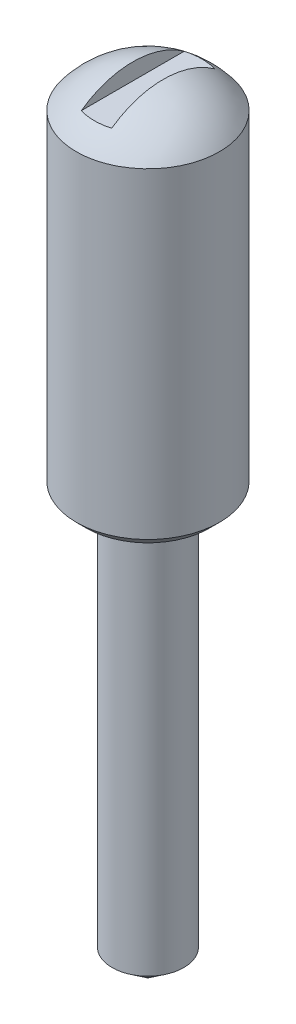
ISO-10303-21;
HEADER;
FILE_DESCRIPTION(('STEP AP214'),'2;1');
FILE_NAME('part.step','',(''),(''),'','','');
FILE_SCHEMA(('AUTOMOTIVE_DESIGN { 1 0 10303 214 1 1 1 1 }'));
ENDSEC;
DATA;
#1=APPLICATION_CONTEXT('core data for automotive mechanical design processes');
#2=APPLICATION_PROTOCOL_DEFINITION('international standard','automotive_design',2000,#1);
#3=PRODUCT_CONTEXT('',#1,'mechanical');
#4=PRODUCT('Part','Part','',(#3));
#5=PRODUCT_RELATED_PRODUCT_CATEGORY('part','',(#4));
#6=PRODUCT_DEFINITION_FORMATION('','',#4);
#7=PRODUCT_DEFINITION_CONTEXT('part definition',#1,'design');
#8=PRODUCT_DEFINITION('design','',#6,#7);
#9=PRODUCT_DEFINITION_SHAPE('','',#8);
#10=(LENGTH_UNIT() NAMED_UNIT(*) SI_UNIT(.MILLI.,.METRE.));
#11=(NAMED_UNIT(*) PLANE_ANGLE_UNIT() SI_UNIT($,.RADIAN.));
#12=(NAMED_UNIT(*) SI_UNIT($,.STERADIAN.) SOLID_ANGLE_UNIT());
#13=UNCERTAINTY_MEASURE_WITH_UNIT(LENGTH_MEASURE(1.E-05),#10,'distance_accuracy_value','');
#14=(GEOMETRIC_REPRESENTATION_CONTEXT(3) GLOBAL_UNCERTAINTY_ASSIGNED_CONTEXT((#13)) GLOBAL_UNIT_ASSIGNED_CONTEXT((#10,
#11,#12)) REPRESENTATION_CONTEXT('',''));
#15=CARTESIAN_POINT('',(0.,0.,0.));
#16=DIRECTION('',(0.,0.,1.));
#17=DIRECTION('',(1.,0.,0.));
#18=AXIS2_PLACEMENT_3D('',#15,#16,#17);
#19=CARTESIAN_POINT('',(0.,0.,0.));
#20=DIRECTION('',(0.,1.,0.));
#21=DIRECTION('',(0.,0.,1.));
#22=AXIS2_PLACEMENT_3D('',#19,#20,#21);
#23=CONICAL_SURFACE('',#22,0.,0.927295218001613);
#24=CARTESIAN_POINT('',(0.,1.5,0.));
#25=DIRECTION('',(0.,1.,0.));
#26=DIRECTION('',(0.,0.,1.));
#27=AXIS2_PLACEMENT_3D('',#24,#25,#26);
#28=CIRCLE('',#27,2.00000000000001);
#29=CARTESIAN_POINT('',(0.,1.5,2.00000000000001));
#30=VERTEX_POINT('',#29);
#31=EDGE_CURVE('E67',#30,#30,#28,.T.);
#32=ORIENTED_EDGE('',*,*,#31,.F.);
#33=EDGE_LOOP('',(#32));
#34=FACE_BOUND('',#33,.T.);
#35=CARTESIAN_POINT('',(0.,0.,0.));
#36=VERTEX_POINT('',#35);
#37=VERTEX_LOOP('',#36);
#38=FACE_BOUND('',#37,.T.);
#39=ADVANCED_FACE('F34',(#34,#38),#23,.T.);
#40=CARTESIAN_POINT('',(0.,42.,0.));
#41=DIRECTION('',(0.,1.,0.));
#42=DIRECTION('',(0.,0.,1.));
#43=AXIS2_PLACEMENT_3D('',#40,#41,#42);
#44=CYLINDRICAL_SURFACE('',#43,2.00000000000001);
#45=CARTESIAN_POINT('',(0.,23.5,0.));
#46=DIRECTION('',(0.,1.,0.));
#47=DIRECTION('',(0.,0.,1.));
#48=AXIS2_PLACEMENT_3D('',#45,#46,#47);
#49=CIRCLE('',#48,2.00000000000001);
#50=CARTESIAN_POINT('',(0.,23.5,2.00000000000001));
#51=VERTEX_POINT('',#50);
#52=EDGE_CURVE('E174',#51,#51,#49,.T.);
#53=ORIENTED_EDGE('',*,*,#52,.F.);
#54=EDGE_LOOP('',(#53));
#55=FACE_BOUND('',#54,.T.);
#56=ORIENTED_EDGE('',*,*,#31,.T.);
#57=EDGE_LOOP('',(#56));
#58=FACE_BOUND('',#57,.T.);
#59=ADVANCED_FACE('F97',(#55,#58),#44,.T.);
#60=CARTESIAN_POINT('',(2.00000000000001,23.5,0.));
#61=DIRECTION('',(0.,1.,0.));
#62=DIRECTION('',(0.,0.,1.));
#63=AXIS2_PLACEMENT_3D('',#60,#61,#62);
#64=PLANE('',#63);
#65=CARTESIAN_POINT('',(0.,23.5,0.));
#66=DIRECTION('',(0.,1.,0.));
#67=DIRECTION('',(0.,0.,1.));
#68=AXIS2_PLACEMENT_3D('',#65,#66,#67);
#69=CIRCLE('',#68,3.44549999999999);
#70=CARTESIAN_POINT('',(0.,23.5,3.44549999999999));
#71=VERTEX_POINT('',#70);
#72=EDGE_CURVE('E11',#71,#71,#69,.F.);
#73=ORIENTED_EDGE('',*,*,#72,.T.);
#74=EDGE_LOOP('',(#73));
#75=FACE_BOUND('',#74,.T.);
#76=ORIENTED_EDGE('',*,*,#52,.T.);
#77=EDGE_LOOP('',(#76));
#78=FACE_BOUND('',#77,.T.);
#79=ADVANCED_FACE('F103',(#75,#78),#64,.F.);
#80=CARTESIAN_POINT('',(0.,42.,0.));
#81=DIRECTION('',(0.,1.,0.));
#82=DIRECTION('',(0.,0.,1.));
#83=AXIS2_PLACEMENT_3D('',#80,#81,#82);
#84=CYLINDRICAL_SURFACE('',#83,4.);
#85=CARTESIAN_POINT('',(0.,24.0545,0.));
#86=DIRECTION('',(0.,1.,0.));
#87=DIRECTION('',(0.,0.,1.));
#88=AXIS2_PLACEMENT_3D('',#85,#86,#87);
#89=CIRCLE('',#88,4.);
#90=CARTESIAN_POINT('',(0.,24.0545,4.));
#91=VERTEX_POINT('',#90);
#92=EDGE_CURVE('E42',#91,#91,#89,.T.);
#93=ORIENTED_EDGE('',*,*,#92,.T.);
#94=EDGE_LOOP('',(#93));
#95=FACE_BOUND('',#94,.T.);
#96=CARTESIAN_POINT('',(0.,42.,0.));
#97=DIRECTION('',(0.,1.,0.));
#98=DIRECTION('',(0.,0.,1.));
#99=AXIS2_PLACEMENT_3D('',#96,#97,#98);
#100=CIRCLE('',#99,4.);
#101=CARTESIAN_POINT('',(0.,42.,4.));
#102=VERTEX_POINT('',#101);
#103=EDGE_CURVE('E175',#102,#102,#100,.T.);
#104=ORIENTED_EDGE('',*,*,#103,.F.);
#105=EDGE_LOOP('',(#104));
#106=FACE_BOUND('',#105,.T.);
#107=ADVANCED_FACE('F86',(#95,#106),#84,.T.);
#108=CARTESIAN_POINT('',(0.,39.,0.));
#109=DIRECTION('',(0.,0.,1.));
#110=DIRECTION('',(1.,0.,0.));
#111=AXIS2_PLACEMENT_3D('',#108,#109,#110);
#112=SPHERICAL_SURFACE('',#111,5.);
#113=CARTESIAN_POINT('',(0.,43.,0.));
#114=DIRECTION('',(0.,-1.,0.));
#115=DIRECTION('',(0.,0.,-1.));
#116=AXIS2_PLACEMENT_3D('',#113,#114,#115);
#117=CIRCLE('',#116,3.);
#118=CARTESIAN_POINT('',(-0.850000000000008,43.,-2.87706447616316));
#119=VERTEX_POINT('',#118);
#120=CARTESIAN_POINT('',(0.849999999999992,43.,-2.87706447616316));
#121=VERTEX_POINT('',#120);
#122=EDGE_CURVE('E66',#119,#121,#117,.T.);
#123=ORIENTED_EDGE('',*,*,#122,.T.);
#124=CARTESIAN_POINT('',(0.849999999999993,39.,0.));
#125=DIRECTION('',(1.,0.,0.));
#126=DIRECTION('',(0.,1.,0.));
#127=AXIS2_PLACEMENT_3D('',#124,#125,#126);
#128=CIRCLE('',#127,4.92722031169706);
#129=CARTESIAN_POINT('',(0.849999999999992,43.,2.87706447616316));
#130=VERTEX_POINT('',#129);
#131=EDGE_CURVE('E79',#121,#130,#128,.T.);
#132=ORIENTED_EDGE('',*,*,#131,.T.);
#133=CARTESIAN_POINT('',(-0.850000000000008,43.,2.87706447616316));
#134=VERTEX_POINT('',#133);
#135=EDGE_CURVE('E72',#130,#134,#117,.T.);
#136=ORIENTED_EDGE('',*,*,#135,.T.);
#137=CARTESIAN_POINT('',(-0.850000000000007,39.,0.));
#138=DIRECTION('',(-1.,0.,0.));
#139=DIRECTION('',(0.,-1.,0.));
#140=AXIS2_PLACEMENT_3D('',#137,#138,#139);
#141=CIRCLE('',#140,4.92722031169705);
#142=EDGE_CURVE('E61',#134,#119,#141,.T.);
#143=ORIENTED_EDGE('',*,*,#142,.T.);
#144=EDGE_LOOP('',(#123,#132,#136,#143));
#145=FACE_BOUND('',#144,.T.);
#146=ORIENTED_EDGE('',*,*,#103,.T.);
#147=EDGE_LOOP('',(#146));
#148=FACE_BOUND('',#147,.T.);
#149=ADVANCED_FACE('F77',(#145,#148),#112,.T.);
#150=CARTESIAN_POINT('',(0.849999999999991,53.,-4.));
#151=DIRECTION('',(1.,0.,0.));
#152=DIRECTION('',(0.,1.,0.));
#153=AXIS2_PLACEMENT_3D('',#150,#151,#152);
#154=PLANE('',#153);
#155=DIRECTION('',(0.,0.,1.));
#156=VECTOR('',#155,1.);
#157=CARTESIAN_POINT('',(0.849999999999992,43.,-4.));
#158=LINE('',#157,#156);
#159=EDGE_CURVE('E74',#121,#130,#158,.T.);
#160=ORIENTED_EDGE('',*,*,#159,.T.);
#161=ORIENTED_EDGE('',*,*,#131,.F.);
#162=EDGE_LOOP('',(#160,#161));
#163=FACE_BOUND('',#162,.T.);
#164=ADVANCED_FACE('F109',(#163),#154,.F.);
#165=CARTESIAN_POINT('',(-0.850000000000008,43.,-4.));
#166=DIRECTION('',(0.,-1.,0.));
#167=DIRECTION('',(0.,0.,-1.));
#168=AXIS2_PLACEMENT_3D('',#165,#166,#167);
#169=PLANE('',#168);
#170=ORIENTED_EDGE('',*,*,#159,.F.);
#171=ORIENTED_EDGE('',*,*,#122,.F.);
#172=DIRECTION('',(0.,0.,1.));
#173=VECTOR('',#172,1.);
#174=CARTESIAN_POINT('',(-0.850000000000008,43.,-4.));
#175=LINE('',#174,#173);
#176=EDGE_CURVE('E48',#119,#134,#175,.T.);
#177=ORIENTED_EDGE('',*,*,#176,.T.);
#178=ORIENTED_EDGE('',*,*,#135,.F.);
#179=EDGE_LOOP('',(#170,#171,#177,#178));
#180=FACE_BOUND('',#179,.T.);
#181=ADVANCED_FACE('F71',(#180),#169,.F.);
#182=CARTESIAN_POINT('',(-0.850000000000009,53.,-4.));
#183=DIRECTION('',(-1.,0.,0.));
#184=DIRECTION('',(0.,-1.,0.));
#185=AXIS2_PLACEMENT_3D('',#182,#183,#184);
#186=PLANE('',#185);
#187=ORIENTED_EDGE('',*,*,#176,.F.);
#188=ORIENTED_EDGE('',*,*,#142,.F.);
#189=EDGE_LOOP('',(#187,#188));
#190=FACE_BOUND('',#189,.T.);
#191=ADVANCED_FACE('F62',(#190),#186,.F.);
#192=CARTESIAN_POINT('',(0.,24.0545,0.));
#193=DIRECTION('',(0.,1.,0.));
#194=DIRECTION('',(0.,0.,1.));
#195=AXIS2_PLACEMENT_3D('',#192,#193,#194);
#196=CONICAL_SURFACE('',#195,4.,0.785398163397456);
#197=ORIENTED_EDGE('',*,*,#72,.F.);
#198=EDGE_LOOP('',(#197));
#199=FACE_BOUND('',#198,.T.);
#200=ORIENTED_EDGE('',*,*,#92,.F.);
#201=EDGE_LOOP('',(#200));
#202=FACE_BOUND('',#201,.T.);
#203=ADVANCED_FACE('F36',(#199,#202),#196,.T.);
#204=CLOSED_SHELL('',(#39,#59,#79,#107,#149,#164,#181,#191,#203));
#205=MANIFOLD_SOLID_BREP('B2',#204);
#206=ADVANCED_BREP_SHAPE_REPRESENTATION('',(#18,#205),#14);
#207=SHAPE_DEFINITION_REPRESENTATION(#9,#206);
ENDSEC;
END-ISO-10303-21;
